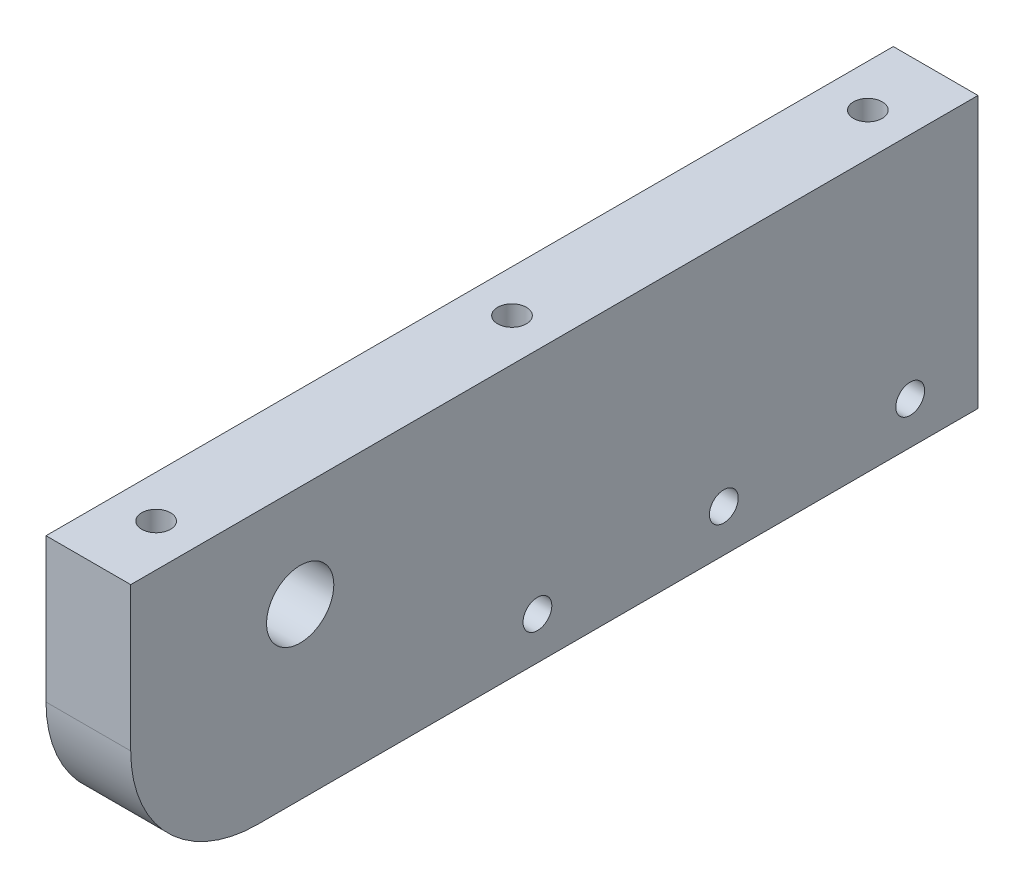
ISO-10303-21;
HEADER;
FILE_DESCRIPTION(('STEP AP214'),'2;1');
FILE_NAME('part.step','',(''),(''),'','','');
FILE_SCHEMA(('AUTOMOTIVE_DESIGN { 1 0 10303 214 1 1 1 1 }'));
ENDSEC;
DATA;
#1=APPLICATION_CONTEXT('core data for automotive mechanical design processes');
#2=APPLICATION_PROTOCOL_DEFINITION('international standard','automotive_design',2000,#1);
#3=PRODUCT_CONTEXT('',#1,'mechanical');
#4=PRODUCT('Part','Part','',(#3));
#5=PRODUCT_RELATED_PRODUCT_CATEGORY('part','',(#4));
#6=PRODUCT_DEFINITION_FORMATION('','',#4);
#7=PRODUCT_DEFINITION_CONTEXT('part definition',#1,'design');
#8=PRODUCT_DEFINITION('design','',#6,#7);
#9=PRODUCT_DEFINITION_SHAPE('','',#8);
#10=(LENGTH_UNIT() NAMED_UNIT(*) SI_UNIT(.MILLI.,.METRE.));
#11=(NAMED_UNIT(*) PLANE_ANGLE_UNIT() SI_UNIT($,.RADIAN.));
#12=(NAMED_UNIT(*) SI_UNIT($,.STERADIAN.) SOLID_ANGLE_UNIT());
#13=UNCERTAINTY_MEASURE_WITH_UNIT(LENGTH_MEASURE(1.E-05),#10,'distance_accuracy_value','');
#14=(GEOMETRIC_REPRESENTATION_CONTEXT(3) GLOBAL_UNCERTAINTY_ASSIGNED_CONTEXT((#13)) GLOBAL_UNIT_ASSIGNED_CONTEXT((#10,
#11,#12)) REPRESENTATION_CONTEXT('',''));
#15=CARTESIAN_POINT('',(0.,0.,0.));
#16=DIRECTION('',(0.,0.,1.));
#17=DIRECTION('',(1.,0.,0.));
#18=AXIS2_PLACEMENT_3D('',#15,#16,#17);
#19=CARTESIAN_POINT('',(0.,0.,0.));
#20=DIRECTION('',(1.,0.,0.));
#21=DIRECTION('',(0.,0.,-1.));
#22=AXIS2_PLACEMENT_3D('',#19,#20,#21);
#23=PLANE('',#22);
#24=CARTESIAN_POINT('',(0.,-11.,-42.));
#25=DIRECTION('',(-1.,0.,0.));
#26=DIRECTION('',(0.,0.,1.));
#27=AXIS2_PLACEMENT_3D('',#24,#25,#26);
#28=CIRCLE('',#27,3.25);
#29=CARTESIAN_POINT('',(0.,-11.,-38.75));
#30=VERTEX_POINT('',#29);
#31=EDGE_CURVE('E293',#30,#30,#28,.T.);
#32=ORIENTED_EDGE('',*,*,#31,.F.);
#33=EDGE_LOOP('',(#32));
#34=FACE_BOUND('',#33,.T.);
#35=CARTESIAN_POINT('',(0.,-11.,-20.));
#36=DIRECTION('',(-1.,0.,0.));
#37=DIRECTION('',(0.,0.,1.));
#38=AXIS2_PLACEMENT_3D('',#35,#36,#37);
#39=CIRCLE('',#38,3.25);
#40=CARTESIAN_POINT('',(0.,-11.,-16.75));
#41=VERTEX_POINT('',#40);
#42=EDGE_CURVE('E198',#41,#41,#39,.T.);
#43=ORIENTED_EDGE('',*,*,#42,.F.);
#44=EDGE_LOOP('',(#43));
#45=FACE_BOUND('',#44,.T.);
#46=CARTESIAN_POINT('',(0.,4.,30.));
#47=DIRECTION('',(1.,0.,0.));
#48=DIRECTION('',(0.,0.,-1.));
#49=AXIS2_PLACEMENT_3D('',#46,#47,#48);
#50=CIRCLE('',#49,3.96875);
#51=CARTESIAN_POINT('',(0.,4.,26.03125));
#52=VERTEX_POINT('',#51);
#53=EDGE_CURVE('E155',#52,#52,#50,.T.);
#54=ORIENTED_EDGE('',*,*,#53,.T.);
#55=EDGE_LOOP('',(#54));
#56=FACE_BOUND('',#55,.T.);
#57=DIRECTION('',(0.,0.,-1.));
#58=VECTOR('',#57,1.);
#59=CARTESIAN_POINT('',(0.,-16.,0.));
#60=LINE('',#59,#58);
#61=CARTESIAN_POINT('',(0.,-16.,35.));
#62=VERTEX_POINT('',#61);
#63=CARTESIAN_POINT('',(0.,-16.,-50.));
#64=VERTEX_POINT('',#63);
#65=EDGE_CURVE('E159',#62,#64,#60,.T.);
#66=ORIENTED_EDGE('',*,*,#65,.F.);
#67=CARTESIAN_POINT('',(0.,-1.,35.));
#68=DIRECTION('',(1.,0.,0.));
#69=DIRECTION('',(0.,0.,-1.));
#70=AXIS2_PLACEMENT_3D('',#67,#68,#69);
#71=CIRCLE('',#70,15.);
#72=CARTESIAN_POINT('',(0.,-1.,50.));
#73=VERTEX_POINT('',#72);
#74=EDGE_CURVE('E72',#62,#73,#71,.F.);
#75=ORIENTED_EDGE('',*,*,#74,.T.);
#76=DIRECTION('',(0.,1.,0.));
#77=VECTOR('',#76,1.);
#78=CARTESIAN_POINT('',(0.,0.,50.));
#79=LINE('',#78,#77);
#80=CARTESIAN_POINT('',(0.,16.,50.));
#81=VERTEX_POINT('',#80);
#82=EDGE_CURVE('E141',#73,#81,#79,.T.);
#83=ORIENTED_EDGE('',*,*,#82,.T.);
#84=DIRECTION('',(0.,0.,-1.));
#85=VECTOR('',#84,1.);
#86=CARTESIAN_POINT('',(0.,16.,0.));
#87=LINE('',#86,#85);
#88=CARTESIAN_POINT('',(0.,16.,-50.));
#89=VERTEX_POINT('',#88);
#90=EDGE_CURVE('E166',#81,#89,#87,.T.);
#91=ORIENTED_EDGE('',*,*,#90,.T.);
#92=DIRECTION('',(0.,1.,0.));
#93=VECTOR('',#92,1.);
#94=CARTESIAN_POINT('',(0.,0.,-50.));
#95=LINE('',#94,#93);
#96=EDGE_CURVE('E162',#64,#89,#95,.T.);
#97=ORIENTED_EDGE('',*,*,#96,.F.);
#98=EDGE_LOOP('',(#66,#75,#83,#91,#97));
#99=FACE_BOUND('',#98,.T.);
#100=CARTESIAN_POINT('',(0.,-11.,2.));
#101=DIRECTION('',(-1.,0.,0.));
#102=DIRECTION('',(0.,0.,1.));
#103=AXIS2_PLACEMENT_3D('',#100,#101,#102);
#104=CIRCLE('',#103,3.25);
#105=CARTESIAN_POINT('',(0.,-11.,5.25));
#106=VERTEX_POINT('',#105);
#107=EDGE_CURVE('E214',#106,#106,#104,.T.);
#108=ORIENTED_EDGE('',*,*,#107,.F.);
#109=EDGE_LOOP('',(#108));
#110=FACE_BOUND('',#109,.T.);
#111=ADVANCED_FACE('F47',(#34,#45,#56,#99,#110),#23,.F.);
#112=CARTESIAN_POINT('',(10.,-16.,0.));
#113=DIRECTION('',(0.,1.,0.));
#114=DIRECTION('',(0.,0.,1.));
#115=AXIS2_PLACEMENT_3D('',#112,#113,#114);
#116=PLANE('',#115);
#117=DIRECTION('',(0.,0.,-1.));
#118=VECTOR('',#117,1.);
#119=CARTESIAN_POINT('',(10.,-16.,0.));
#120=LINE('',#119,#118);
#121=CARTESIAN_POINT('',(10.,-16.,35.));
#122=VERTEX_POINT('',#121);
#123=CARTESIAN_POINT('',(10.,-16.,-50.));
#124=VERTEX_POINT('',#123);
#125=EDGE_CURVE('E140',#122,#124,#120,.T.);
#126=ORIENTED_EDGE('',*,*,#125,.F.);
#127=DIRECTION('',(-1.,0.,0.));
#128=VECTOR('',#127,1.);
#129=CARTESIAN_POINT('',(0.,-16.,35.));
#130=LINE('',#129,#128);
#131=EDGE_CURVE('E182',#122,#62,#130,.T.);
#132=ORIENTED_EDGE('',*,*,#131,.T.);
#133=ORIENTED_EDGE('',*,*,#65,.T.);
#134=DIRECTION('',(-1.,0.,0.));
#135=VECTOR('',#134,1.);
#136=CARTESIAN_POINT('',(10.,-16.,-50.));
#137=LINE('',#136,#135);
#138=EDGE_CURVE('E178',#124,#64,#137,.T.);
#139=ORIENTED_EDGE('',*,*,#138,.F.);
#140=EDGE_LOOP('',(#126,#132,#133,#139));
#141=FACE_BOUND('',#140,.T.);
#142=ADVANCED_FACE('F241',(#141),#116,.F.);
#143=CARTESIAN_POINT('',(10.,0.,-50.));
#144=DIRECTION('',(0.,0.,1.));
#145=DIRECTION('',(1.,0.,0.));
#146=AXIS2_PLACEMENT_3D('',#143,#144,#145);
#147=PLANE('',#146);
#148=ORIENTED_EDGE('',*,*,#96,.T.);
#149=DIRECTION('',(-1.,0.,0.));
#150=VECTOR('',#149,1.);
#151=CARTESIAN_POINT('',(10.,16.,-50.));
#152=LINE('',#151,#150);
#153=CARTESIAN_POINT('',(10.,16.,-50.));
#154=VERTEX_POINT('',#153);
#155=EDGE_CURVE('E175',#154,#89,#152,.T.);
#156=ORIENTED_EDGE('',*,*,#155,.F.);
#157=DIRECTION('',(0.,1.,0.));
#158=VECTOR('',#157,1.);
#159=CARTESIAN_POINT('',(10.,0.,-50.));
#160=LINE('',#159,#158);
#161=EDGE_CURVE('E144',#124,#154,#160,.T.);
#162=ORIENTED_EDGE('',*,*,#161,.F.);
#163=ORIENTED_EDGE('',*,*,#138,.T.);
#164=EDGE_LOOP('',(#148,#156,#162,#163));
#165=FACE_BOUND('',#164,.T.);
#166=ADVANCED_FACE('F249',(#165),#147,.F.);
#167=CARTESIAN_POINT('',(10.,16.,0.));
#168=DIRECTION('',(0.,1.,0.));
#169=DIRECTION('',(0.,0.,1.));
#170=AXIS2_PLACEMENT_3D('',#167,#168,#169);
#171=PLANE('',#170);
#172=CARTESIAN_POINT('',(5.,16.,-42.));
#173=DIRECTION('',(0.,1.,0.));
#174=DIRECTION('',(0.,0.,1.));
#175=AXIS2_PLACEMENT_3D('',#172,#173,#174);
#176=CIRCLE('',#175,1.7);
#177=CARTESIAN_POINT('',(5.,16.,-40.3));
#178=VERTEX_POINT('',#177);
#179=EDGE_CURVE('E113',#178,#178,#176,.T.);
#180=ORIENTED_EDGE('',*,*,#179,.F.);
#181=EDGE_LOOP('',(#180));
#182=FACE_BOUND('',#181,.T.);
#183=CARTESIAN_POINT('',(5.,16.,42.));
#184=DIRECTION('',(0.,1.,0.));
#185=DIRECTION('',(0.,0.,1.));
#186=AXIS2_PLACEMENT_3D('',#183,#184,#185);
#187=CIRCLE('',#186,1.7);
#188=CARTESIAN_POINT('',(5.,16.,43.7));
#189=VERTEX_POINT('',#188);
#190=EDGE_CURVE('E130',#189,#189,#187,.T.);
#191=ORIENTED_EDGE('',*,*,#190,.F.);
#192=EDGE_LOOP('',(#191));
#193=FACE_BOUND('',#192,.T.);
#194=CARTESIAN_POINT('',(5.,16.,0.));
#195=DIRECTION('',(0.,1.,0.));
#196=DIRECTION('',(0.,0.,1.));
#197=AXIS2_PLACEMENT_3D('',#194,#195,#196);
#198=CIRCLE('',#197,1.7);
#199=CARTESIAN_POINT('',(5.,16.,1.7));
#200=VERTEX_POINT('',#199);
#201=EDGE_CURVE('E135',#200,#200,#198,.T.);
#202=ORIENTED_EDGE('',*,*,#201,.F.);
#203=EDGE_LOOP('',(#202));
#204=FACE_BOUND('',#203,.T.);
#205=ORIENTED_EDGE('',*,*,#90,.F.);
#206=DIRECTION('',(-1.,0.,0.));
#207=VECTOR('',#206,1.);
#208=CARTESIAN_POINT('',(10.,16.,50.));
#209=LINE('',#208,#207);
#210=CARTESIAN_POINT('',(10.,16.,50.));
#211=VERTEX_POINT('',#210);
#212=EDGE_CURVE('E154',#211,#81,#209,.T.);
#213=ORIENTED_EDGE('',*,*,#212,.F.);
#214=DIRECTION('',(0.,0.,-1.));
#215=VECTOR('',#214,1.);
#216=CARTESIAN_POINT('',(10.,16.,0.));
#217=LINE('',#216,#215);
#218=EDGE_CURVE('E147',#211,#154,#217,.T.);
#219=ORIENTED_EDGE('',*,*,#218,.T.);
#220=ORIENTED_EDGE('',*,*,#155,.T.);
#221=EDGE_LOOP('',(#205,#213,#219,#220));
#222=FACE_BOUND('',#221,.T.);
#223=ADVANCED_FACE('F262',(#182,#193,#204,#222),#171,.T.);
#224=CARTESIAN_POINT('',(10.,4.,30.));
#225=DIRECTION('',(-1.,0.,0.));
#226=DIRECTION('',(0.,0.,1.));
#227=AXIS2_PLACEMENT_3D('',#224,#225,#226);
#228=CYLINDRICAL_SURFACE('',#227,3.96875);
#229=CARTESIAN_POINT('',(10.,4.,30.));
#230=DIRECTION('',(1.,0.,0.));
#231=DIRECTION('',(0.,0.,-1.));
#232=AXIS2_PLACEMENT_3D('',#229,#230,#231);
#233=CIRCLE('',#232,3.96875);
#234=CARTESIAN_POINT('',(10.,4.,26.03125));
#235=VERTEX_POINT('',#234);
#236=EDGE_CURVE('E136',#235,#235,#233,.T.);
#237=ORIENTED_EDGE('',*,*,#236,.T.);
#238=EDGE_LOOP('',(#237));
#239=FACE_BOUND('',#238,.T.);
#240=ORIENTED_EDGE('',*,*,#53,.F.);
#241=EDGE_LOOP('',(#240));
#242=FACE_BOUND('',#241,.T.);
#243=ADVANCED_FACE('F261',(#239,#242),#228,.F.);
#244=CARTESIAN_POINT('',(10.,0.,50.));
#245=DIRECTION('',(0.,0.,1.));
#246=DIRECTION('',(1.,0.,0.));
#247=AXIS2_PLACEMENT_3D('',#244,#245,#246);
#248=PLANE('',#247);
#249=ORIENTED_EDGE('',*,*,#82,.F.);
#250=DIRECTION('',(-1.,0.,0.));
#251=VECTOR('',#250,1.);
#252=CARTESIAN_POINT('',(10.,-1.,50.));
#253=LINE('',#252,#251);
#254=CARTESIAN_POINT('',(10.,-1.,50.));
#255=VERTEX_POINT('',#254);
#256=EDGE_CURVE('E57',#73,#255,#253,.F.);
#257=ORIENTED_EDGE('',*,*,#256,.T.);
#258=DIRECTION('',(0.,1.,0.));
#259=VECTOR('',#258,1.);
#260=CARTESIAN_POINT('',(10.,0.,50.));
#261=LINE('',#260,#259);
#262=EDGE_CURVE('E151',#255,#211,#261,.T.);
#263=ORIENTED_EDGE('',*,*,#262,.T.);
#264=ORIENTED_EDGE('',*,*,#212,.T.);
#265=EDGE_LOOP('',(#249,#257,#263,#264));
#266=FACE_BOUND('',#265,.T.);
#267=ADVANCED_FACE('F258',(#266),#248,.T.);
#268=CARTESIAN_POINT('',(10.,0.,0.));
#269=DIRECTION('',(1.,0.,0.));
#270=DIRECTION('',(0.,0.,-1.));
#271=AXIS2_PLACEMENT_3D('',#268,#269,#270);
#272=PLANE('',#271);
#273=CARTESIAN_POINT('',(10.,-11.,-42.));
#274=DIRECTION('',(1.,0.,0.));
#275=DIRECTION('',(0.,0.,-1.));
#276=AXIS2_PLACEMENT_3D('',#273,#274,#275);
#277=CIRCLE('',#276,1.69999999999999);
#278=CARTESIAN_POINT('',(10.,-11.,-43.7));
#279=VERTEX_POINT('',#278);
#280=EDGE_CURVE('E51',#279,#279,#277,.T.);
#281=ORIENTED_EDGE('',*,*,#280,.F.);
#282=EDGE_LOOP('',(#281));
#283=FACE_BOUND('',#282,.T.);
#284=CARTESIAN_POINT('',(10.,-11.,2.));
#285=DIRECTION('',(1.,0.,0.));
#286=DIRECTION('',(0.,0.,-1.));
#287=AXIS2_PLACEMENT_3D('',#284,#285,#286);
#288=CIRCLE('',#287,1.69999999999999);
#289=CARTESIAN_POINT('',(10.,-11.,0.300000000000008));
#290=VERTEX_POINT('',#289);
#291=EDGE_CURVE('E195',#290,#290,#288,.T.);
#292=ORIENTED_EDGE('',*,*,#291,.F.);
#293=EDGE_LOOP('',(#292));
#294=FACE_BOUND('',#293,.T.);
#295=CARTESIAN_POINT('',(10.,-11.,-20.));
#296=DIRECTION('',(1.,0.,0.));
#297=DIRECTION('',(0.,0.,-1.));
#298=AXIS2_PLACEMENT_3D('',#295,#296,#297);
#299=CIRCLE('',#298,1.69999999999999);
#300=CARTESIAN_POINT('',(10.,-11.,-21.7));
#301=VERTEX_POINT('',#300);
#302=EDGE_CURVE('E114',#301,#301,#299,.T.);
#303=ORIENTED_EDGE('',*,*,#302,.F.);
#304=EDGE_LOOP('',(#303));
#305=FACE_BOUND('',#304,.T.);
#306=ORIENTED_EDGE('',*,*,#236,.F.);
#307=EDGE_LOOP('',(#306));
#308=FACE_BOUND('',#307,.T.);
#309=ORIENTED_EDGE('',*,*,#262,.F.);
#310=CARTESIAN_POINT('',(10.,-1.,35.));
#311=DIRECTION('',(1.,0.,0.));
#312=DIRECTION('',(0.,0.,-1.));
#313=AXIS2_PLACEMENT_3D('',#310,#311,#312);
#314=CIRCLE('',#313,15.);
#315=EDGE_CURVE('E11',#255,#122,#314,.T.);
#316=ORIENTED_EDGE('',*,*,#315,.T.);
#317=ORIENTED_EDGE('',*,*,#125,.T.);
#318=ORIENTED_EDGE('',*,*,#161,.T.);
#319=ORIENTED_EDGE('',*,*,#218,.F.);
#320=EDGE_LOOP('',(#309,#316,#317,#318,#319));
#321=FACE_BOUND('',#320,.T.);
#322=ADVANCED_FACE('F256',(#283,#294,#305,#308,#321),#272,.T.);
#323=CARTESIAN_POINT('',(10.,-1.,35.));
#324=DIRECTION('',(1.,0.,0.));
#325=DIRECTION('',(0.,0.,-1.));
#326=AXIS2_PLACEMENT_3D('',#323,#324,#325);
#327=CYLINDRICAL_SURFACE('',#326,15.);
#328=ORIENTED_EDGE('',*,*,#315,.F.);
#329=ORIENTED_EDGE('',*,*,#256,.F.);
#330=ORIENTED_EDGE('',*,*,#74,.F.);
#331=ORIENTED_EDGE('',*,*,#131,.F.);
#332=EDGE_LOOP('',(#328,#329,#330,#331));
#333=FACE_BOUND('',#332,.T.);
#334=ADVANCED_FACE('F49',(#333),#327,.T.);
#335=CARTESIAN_POINT('',(5.,3.00000000000002,0.));
#336=DIRECTION('',(0.,1.,0.));
#337=DIRECTION('',(0.,0.,1.));
#338=AXIS2_PLACEMENT_3D('',#335,#336,#337);
#339=CONICAL_SURFACE('',#338,1.69999999999999,1.02974425867665);
#340=CARTESIAN_POINT('',(5.,1.97853694765317,0.));
#341=VERTEX_POINT('',#340);
#342=VERTEX_LOOP('',#341);
#343=FACE_BOUND('',#342,.T.);
#344=CARTESIAN_POINT('',(5.,3.00000000000002,0.));
#345=DIRECTION('',(0.,1.,0.));
#346=DIRECTION('',(0.,0.,1.));
#347=AXIS2_PLACEMENT_3D('',#344,#345,#346);
#348=CIRCLE('',#347,1.69999999999999);
#349=CARTESIAN_POINT('',(5.,3.00000000000002,1.69999999999999));
#350=VERTEX_POINT('',#349);
#351=EDGE_CURVE('E131',#350,#350,#348,.T.);
#352=ORIENTED_EDGE('',*,*,#351,.T.);
#353=EDGE_LOOP('',(#352));
#354=FACE_BOUND('',#353,.T.);
#355=ADVANCED_FACE('F410',(#343,#354),#339,.F.);
#356=CARTESIAN_POINT('',(5.,26.,0.));
#357=DIRECTION('',(0.,1.,0.));
#358=DIRECTION('',(0.,0.,1.));
#359=AXIS2_PLACEMENT_3D('',#356,#357,#358);
#360=CYLINDRICAL_SURFACE('',#359,1.7);
#361=ORIENTED_EDGE('',*,*,#201,.T.);
#362=EDGE_LOOP('',(#361));
#363=FACE_BOUND('',#362,.T.);
#364=ORIENTED_EDGE('',*,*,#351,.F.);
#365=EDGE_LOOP('',(#364));
#366=FACE_BOUND('',#365,.T.);
#367=ADVANCED_FACE('F401',(#363,#366),#360,.F.);
#368=CARTESIAN_POINT('',(5.,3.00000000000002,42.));
#369=DIRECTION('',(0.,1.,0.));
#370=DIRECTION('',(0.,0.,1.));
#371=AXIS2_PLACEMENT_3D('',#368,#369,#370);
#372=CONICAL_SURFACE('',#371,1.69999999999999,1.02974425867665);
#373=CARTESIAN_POINT('',(5.,1.97853694765317,42.));
#374=VERTEX_POINT('',#373);
#375=VERTEX_LOOP('',#374);
#376=FACE_BOUND('',#375,.T.);
#377=CARTESIAN_POINT('',(5.,3.00000000000002,42.));
#378=DIRECTION('',(0.,1.,0.));
#379=DIRECTION('',(0.,0.,1.));
#380=AXIS2_PLACEMENT_3D('',#377,#378,#379);
#381=CIRCLE('',#380,1.69999999999999);
#382=CARTESIAN_POINT('',(5.,3.00000000000002,43.7));
#383=VERTEX_POINT('',#382);
#384=EDGE_CURVE('E119',#383,#383,#381,.T.);
#385=ORIENTED_EDGE('',*,*,#384,.T.);
#386=EDGE_LOOP('',(#385));
#387=FACE_BOUND('',#386,.T.);
#388=ADVANCED_FACE('F392',(#376,#387),#372,.F.);
#389=CARTESIAN_POINT('',(5.,26.,42.));
#390=DIRECTION('',(0.,1.,0.));
#391=DIRECTION('',(0.,0.,1.));
#392=AXIS2_PLACEMENT_3D('',#389,#390,#391);
#393=CYLINDRICAL_SURFACE('',#392,1.7);
#394=ORIENTED_EDGE('',*,*,#190,.T.);
#395=EDGE_LOOP('',(#394));
#396=FACE_BOUND('',#395,.T.);
#397=ORIENTED_EDGE('',*,*,#384,.F.);
#398=EDGE_LOOP('',(#397));
#399=FACE_BOUND('',#398,.T.);
#400=ADVANCED_FACE('F106',(#396,#399),#393,.F.);
#401=CARTESIAN_POINT('',(5.,3.00000000000002,-42.));
#402=DIRECTION('',(0.,1.,0.));
#403=DIRECTION('',(0.,0.,1.));
#404=AXIS2_PLACEMENT_3D('',#401,#402,#403);
#405=CONICAL_SURFACE('',#404,1.69999999999999,1.02974425867665);
#406=CARTESIAN_POINT('',(5.,1.97853694765317,-42.));
#407=VERTEX_POINT('',#406);
#408=VERTEX_LOOP('',#407);
#409=FACE_BOUND('',#408,.T.);
#410=CARTESIAN_POINT('',(5.,3.00000000000002,-42.));
#411=DIRECTION('',(0.,1.,0.));
#412=DIRECTION('',(0.,0.,1.));
#413=AXIS2_PLACEMENT_3D('',#410,#411,#412);
#414=CIRCLE('',#413,1.69999999999999);
#415=CARTESIAN_POINT('',(5.,3.00000000000002,-40.3));
#416=VERTEX_POINT('',#415);
#417=EDGE_CURVE('E110',#416,#416,#414,.T.);
#418=ORIENTED_EDGE('',*,*,#417,.T.);
#419=EDGE_LOOP('',(#418));
#420=FACE_BOUND('',#419,.T.);
#421=ADVANCED_FACE('F102',(#409,#420),#405,.F.);
#422=CARTESIAN_POINT('',(5.,26.,-42.));
#423=DIRECTION('',(0.,1.,0.));
#424=DIRECTION('',(0.,0.,1.));
#425=AXIS2_PLACEMENT_3D('',#422,#423,#424);
#426=CYLINDRICAL_SURFACE('',#425,1.7);
#427=ORIENTED_EDGE('',*,*,#179,.T.);
#428=EDGE_LOOP('',(#427));
#429=FACE_BOUND('',#428,.T.);
#430=ORIENTED_EDGE('',*,*,#417,.F.);
#431=EDGE_LOOP('',(#430));
#432=FACE_BOUND('',#431,.T.);
#433=ADVANCED_FACE('F105',(#429,#432),#426,.F.);
#434=CARTESIAN_POINT('',(0.,-11.,-20.));
#435=DIRECTION('',(-1.,0.,0.));
#436=DIRECTION('',(0.,0.,1.));
#437=AXIS2_PLACEMENT_3D('',#434,#435,#436);
#438=CYLINDRICAL_SURFACE('',#437,1.69999999999999);
#439=ORIENTED_EDGE('',*,*,#302,.T.);
#440=EDGE_LOOP('',(#439));
#441=FACE_BOUND('',#440,.T.);
#442=CARTESIAN_POINT('',(3.,-11.,-20.));
#443=DIRECTION('',(-1.,0.,0.));
#444=DIRECTION('',(0.,0.,1.));
#445=AXIS2_PLACEMENT_3D('',#442,#443,#444);
#446=CIRCLE('',#445,1.69999999999999);
#447=CARTESIAN_POINT('',(3.,-11.,-18.3));
#448=VERTEX_POINT('',#447);
#449=EDGE_CURVE('E122',#448,#448,#446,.T.);
#450=ORIENTED_EDGE('',*,*,#449,.T.);
#451=EDGE_LOOP('',(#450));
#452=FACE_BOUND('',#451,.T.);
#453=ADVANCED_FACE('F225',(#441,#452),#438,.F.);
#454=CARTESIAN_POINT('',(3.,-9.30000000000001,-20.));
#455=DIRECTION('',(1.,0.,0.));
#456=DIRECTION('',(0.,0.,-1.));
#457=AXIS2_PLACEMENT_3D('',#454,#455,#456);
#458=PLANE('',#457);
#459=ORIENTED_EDGE('',*,*,#449,.F.);
#460=EDGE_LOOP('',(#459));
#461=FACE_BOUND('',#460,.T.);
#462=CARTESIAN_POINT('',(3.,-11.,-20.));
#463=DIRECTION('',(-1.,0.,0.));
#464=DIRECTION('',(0.,0.,1.));
#465=AXIS2_PLACEMENT_3D('',#462,#463,#464);
#466=CIRCLE('',#465,3.25);
#467=CARTESIAN_POINT('',(3.,-11.,-16.75));
#468=VERTEX_POINT('',#467);
#469=EDGE_CURVE('E205',#468,#468,#466,.T.);
#470=ORIENTED_EDGE('',*,*,#469,.T.);
#471=EDGE_LOOP('',(#470));
#472=FACE_BOUND('',#471,.T.);
#473=ADVANCED_FACE('F227',(#461,#472),#458,.F.);
#474=CARTESIAN_POINT('',(0.,-11.,-20.));
#475=DIRECTION('',(-1.,0.,0.));
#476=DIRECTION('',(0.,0.,1.));
#477=AXIS2_PLACEMENT_3D('',#474,#475,#476);
#478=CYLINDRICAL_SURFACE('',#477,3.25);
#479=ORIENTED_EDGE('',*,*,#469,.F.);
#480=EDGE_LOOP('',(#479));
#481=FACE_BOUND('',#480,.T.);
#482=ORIENTED_EDGE('',*,*,#42,.T.);
#483=EDGE_LOOP('',(#482));
#484=FACE_BOUND('',#483,.T.);
#485=ADVANCED_FACE('F229',(#481,#484),#478,.F.);
#486=CARTESIAN_POINT('',(0.,-11.,2.));
#487=DIRECTION('',(-1.,0.,0.));
#488=DIRECTION('',(0.,0.,1.));
#489=AXIS2_PLACEMENT_3D('',#486,#487,#488);
#490=CYLINDRICAL_SURFACE('',#489,1.69999999999999);
#491=ORIENTED_EDGE('',*,*,#291,.T.);
#492=EDGE_LOOP('',(#491));
#493=FACE_BOUND('',#492,.T.);
#494=CARTESIAN_POINT('',(3.,-11.,2.));
#495=DIRECTION('',(-1.,0.,0.));
#496=DIRECTION('',(0.,0.,1.));
#497=AXIS2_PLACEMENT_3D('',#494,#495,#496);
#498=CIRCLE('',#497,1.69999999999999);
#499=CARTESIAN_POINT('',(3.,-11.,3.7));
#500=VERTEX_POINT('',#499);
#501=EDGE_CURVE('E199',#500,#500,#498,.T.);
#502=ORIENTED_EDGE('',*,*,#501,.T.);
#503=EDGE_LOOP('',(#502));
#504=FACE_BOUND('',#503,.T.);
#505=ADVANCED_FACE('F235',(#493,#504),#490,.F.);
#506=CARTESIAN_POINT('',(3.,-9.30000000000001,2.));
#507=DIRECTION('',(1.,0.,0.));
#508=DIRECTION('',(0.,0.,-1.));
#509=AXIS2_PLACEMENT_3D('',#506,#507,#508);
#510=PLANE('',#509);
#511=ORIENTED_EDGE('',*,*,#501,.F.);
#512=EDGE_LOOP('',(#511));
#513=FACE_BOUND('',#512,.T.);
#514=CARTESIAN_POINT('',(3.,-11.,2.));
#515=DIRECTION('',(-1.,0.,0.));
#516=DIRECTION('',(0.,0.,1.));
#517=AXIS2_PLACEMENT_3D('',#514,#515,#516);
#518=CIRCLE('',#517,3.25);
#519=CARTESIAN_POINT('',(3.,-11.,5.25));
#520=VERTEX_POINT('',#519);
#521=EDGE_CURVE('E208',#520,#520,#518,.T.);
#522=ORIENTED_EDGE('',*,*,#521,.T.);
#523=EDGE_LOOP('',(#522));
#524=FACE_BOUND('',#523,.T.);
#525=ADVANCED_FACE('F316',(#513,#524),#510,.F.);
#526=CARTESIAN_POINT('',(0.,-11.,2.));
#527=DIRECTION('',(-1.,0.,0.));
#528=DIRECTION('',(0.,0.,1.));
#529=AXIS2_PLACEMENT_3D('',#526,#527,#528);
#530=CYLINDRICAL_SURFACE('',#529,3.25);
#531=ORIENTED_EDGE('',*,*,#521,.F.);
#532=EDGE_LOOP('',(#531));
#533=FACE_BOUND('',#532,.T.);
#534=ORIENTED_EDGE('',*,*,#107,.T.);
#535=EDGE_LOOP('',(#534));
#536=FACE_BOUND('',#535,.T.);
#537=ADVANCED_FACE('F312',(#533,#536),#530,.F.);
#538=CARTESIAN_POINT('',(0.,-11.,-42.));
#539=DIRECTION('',(-1.,0.,0.));
#540=DIRECTION('',(0.,0.,1.));
#541=AXIS2_PLACEMENT_3D('',#538,#539,#540);
#542=CYLINDRICAL_SURFACE('',#541,1.69999999999999);
#543=ORIENTED_EDGE('',*,*,#280,.T.);
#544=EDGE_LOOP('',(#543));
#545=FACE_BOUND('',#544,.T.);
#546=CARTESIAN_POINT('',(3.,-11.,-42.));
#547=DIRECTION('',(-1.,0.,0.));
#548=DIRECTION('',(0.,0.,1.));
#549=AXIS2_PLACEMENT_3D('',#546,#547,#548);
#550=CIRCLE('',#549,1.69999999999999);
#551=CARTESIAN_POINT('',(3.,-11.,-40.3));
#552=VERTEX_POINT('',#551);
#553=EDGE_CURVE('E284',#552,#552,#550,.T.);
#554=ORIENTED_EDGE('',*,*,#553,.T.);
#555=EDGE_LOOP('',(#554));
#556=FACE_BOUND('',#555,.T.);
#557=ADVANCED_FACE('F305',(#545,#556),#542,.F.);
#558=CARTESIAN_POINT('',(3.,-9.30000000000001,-42.));
#559=DIRECTION('',(1.,0.,0.));
#560=DIRECTION('',(0.,0.,-1.));
#561=AXIS2_PLACEMENT_3D('',#558,#559,#560);
#562=PLANE('',#561);
#563=ORIENTED_EDGE('',*,*,#553,.F.);
#564=EDGE_LOOP('',(#563));
#565=FACE_BOUND('',#564,.T.);
#566=CARTESIAN_POINT('',(3.,-11.,-42.));
#567=DIRECTION('',(-1.,0.,0.));
#568=DIRECTION('',(0.,0.,1.));
#569=AXIS2_PLACEMENT_3D('',#566,#567,#568);
#570=CIRCLE('',#569,3.25);
#571=CARTESIAN_POINT('',(3.,-11.,-38.75));
#572=VERTEX_POINT('',#571);
#573=EDGE_CURVE('E289',#572,#572,#570,.T.);
#574=ORIENTED_EDGE('',*,*,#573,.T.);
#575=EDGE_LOOP('',(#574));
#576=FACE_BOUND('',#575,.T.);
#577=ADVANCED_FACE('F299',(#565,#576),#562,.F.);
#578=CARTESIAN_POINT('',(0.,-11.,-42.));
#579=DIRECTION('',(-1.,0.,0.));
#580=DIRECTION('',(0.,0.,1.));
#581=AXIS2_PLACEMENT_3D('',#578,#579,#580);
#582=CYLINDRICAL_SURFACE('',#581,3.25);
#583=ORIENTED_EDGE('',*,*,#573,.F.);
#584=EDGE_LOOP('',(#583));
#585=FACE_BOUND('',#584,.T.);
#586=ORIENTED_EDGE('',*,*,#31,.T.);
#587=EDGE_LOOP('',(#586));
#588=FACE_BOUND('',#587,.T.);
#589=ADVANCED_FACE('F297',(#585,#588),#582,.F.);
#590=CLOSED_SHELL('',(#111,#142,#166,#223,#243,#267,#322,#334,#355,#367,#388,#400,#421,#433,
#453,#473,#485,#505,#525,#537,#557,#577,#589));
#591=MANIFOLD_SOLID_BREP('B2',#590);
#592=ADVANCED_BREP_SHAPE_REPRESENTATION('',(#18,#591),#14);
#593=SHAPE_DEFINITION_REPRESENTATION(#9,#592);
ENDSEC;
END-ISO-10303-21;
